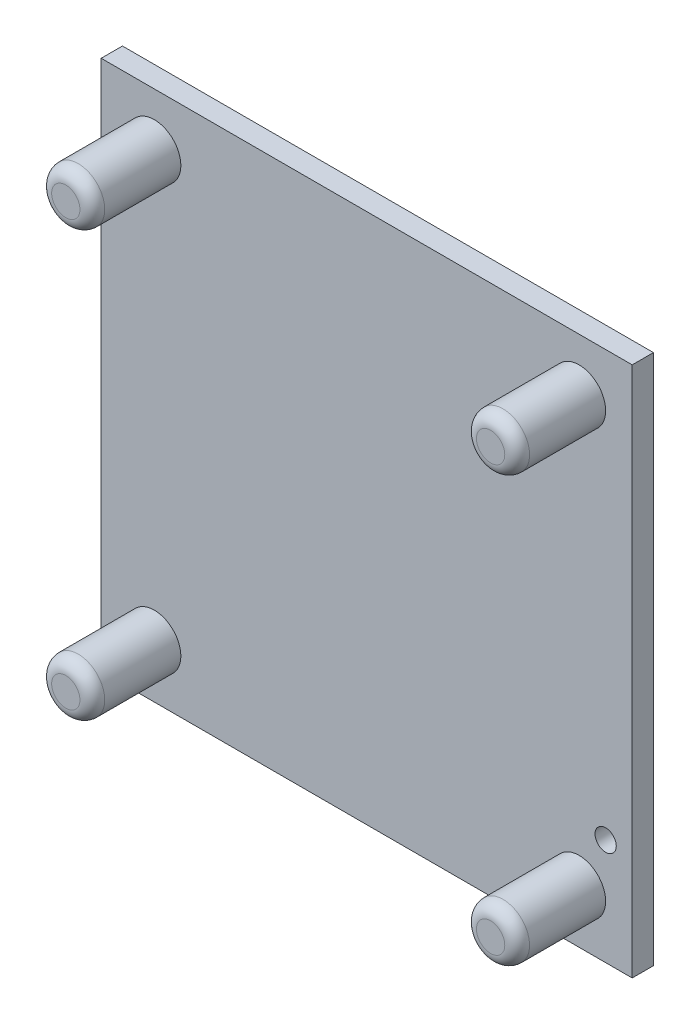
ISO-10303-21;
HEADER;
FILE_DESCRIPTION(('STEP AP214'),'2;1');
FILE_NAME('part.step','',(''),(''),'','','');
FILE_SCHEMA(('AUTOMOTIVE_DESIGN { 1 0 10303 214 1 1 1 1 }'));
ENDSEC;
DATA;
#1=APPLICATION_CONTEXT('core data for automotive mechanical design processes');
#2=APPLICATION_PROTOCOL_DEFINITION('international standard','automotive_design',2000,#1);
#3=PRODUCT_CONTEXT('',#1,'mechanical');
#4=PRODUCT('Part','Part','',(#3));
#5=PRODUCT_RELATED_PRODUCT_CATEGORY('part','',(#4));
#6=PRODUCT_DEFINITION_FORMATION('','',#4);
#7=PRODUCT_DEFINITION_CONTEXT('part definition',#1,'design');
#8=PRODUCT_DEFINITION('design','',#6,#7);
#9=PRODUCT_DEFINITION_SHAPE('','',#8);
#10=(LENGTH_UNIT() NAMED_UNIT(*) SI_UNIT(.MILLI.,.METRE.));
#11=(NAMED_UNIT(*) PLANE_ANGLE_UNIT() SI_UNIT($,.RADIAN.));
#12=(NAMED_UNIT(*) SI_UNIT($,.STERADIAN.) SOLID_ANGLE_UNIT());
#13=UNCERTAINTY_MEASURE_WITH_UNIT(LENGTH_MEASURE(1.E-05),#10,'distance_accuracy_value','');
#14=(GEOMETRIC_REPRESENTATION_CONTEXT(3) GLOBAL_UNCERTAINTY_ASSIGNED_CONTEXT((#13)) GLOBAL_UNIT_ASSIGNED_CONTEXT((#10,
#11,#12)) REPRESENTATION_CONTEXT('',''));
#15=CARTESIAN_POINT('',(0.,0.,0.));
#16=DIRECTION('',(0.,0.,1.));
#17=DIRECTION('',(1.,0.,0.));
#18=AXIS2_PLACEMENT_3D('',#15,#16,#17);
#19=CARTESIAN_POINT('',(150.,-150.,12.));
#20=DIRECTION('',(0.,0.,1.));
#21=DIRECTION('',(1.,0.,0.));
#22=AXIS2_PLACEMENT_3D('',#19,#20,#21);
#23=PLANE('',#22);
#24=CARTESIAN_POINT('',(135.,-90.,12.));
#25=DIRECTION('',(0.,0.,1.));
#26=DIRECTION('',(1.,0.,0.));
#27=AXIS2_PLACEMENT_3D('',#24,#25,#26);
#28=CIRCLE('',#27,6.00000000000001);
#29=CARTESIAN_POINT('',(141.,-90.,12.));
#30=VERTEX_POINT('',#29);
#31=EDGE_CURVE('E232',#30,#30,#28,.T.);
#32=ORIENTED_EDGE('',*,*,#31,.F.);
#33=EDGE_LOOP('',(#32));
#34=FACE_BOUND('',#33,.T.);
#35=CARTESIAN_POINT('',(-120.000000000001,120.,12.));
#36=DIRECTION('',(0.,0.,1.));
#37=DIRECTION('',(1.,0.,0.));
#38=AXIS2_PLACEMENT_3D('',#35,#36,#37);
#39=CIRCLE('',#38,15.);
#40=CARTESIAN_POINT('',(-105.000000000001,120.,12.));
#41=VERTEX_POINT('',#40);
#42=EDGE_CURVE('E221',#41,#41,#39,.T.);
#43=ORIENTED_EDGE('',*,*,#42,.F.);
#44=EDGE_LOOP('',(#43));
#45=FACE_BOUND('',#44,.T.);
#46=CARTESIAN_POINT('',(-120.,-120.,12.));
#47=DIRECTION('',(0.,0.,1.));
#48=DIRECTION('',(1.,0.,0.));
#49=AXIS2_PLACEMENT_3D('',#46,#47,#48);
#50=CIRCLE('',#49,15.);
#51=CARTESIAN_POINT('',(-105.,-120.,12.));
#52=VERTEX_POINT('',#51);
#53=EDGE_CURVE('E102',#52,#52,#50,.T.);
#54=ORIENTED_EDGE('',*,*,#53,.F.);
#55=EDGE_LOOP('',(#54));
#56=FACE_BOUND('',#55,.T.);
#57=DIRECTION('',(0.,1.,0.));
#58=VECTOR('',#57,1.);
#59=CARTESIAN_POINT('',(150.,150.,12.));
#60=LINE('',#59,#58);
#61=CARTESIAN_POINT('',(150.,-150.,12.));
#62=VERTEX_POINT('',#61);
#63=CARTESIAN_POINT('',(150.,150.,12.));
#64=VERTEX_POINT('',#63);
#65=EDGE_CURVE('E84',#62,#64,#60,.T.);
#66=ORIENTED_EDGE('',*,*,#65,.T.);
#67=DIRECTION('',(-1.,0.,0.));
#68=VECTOR('',#67,1.);
#69=CARTESIAN_POINT('',(-150.,150.,12.));
#70=LINE('',#69,#68);
#71=CARTESIAN_POINT('',(-150.,150.,12.));
#72=VERTEX_POINT('',#71);
#73=EDGE_CURVE('E79',#64,#72,#70,.T.);
#74=ORIENTED_EDGE('',*,*,#73,.T.);
#75=DIRECTION('',(0.,-1.,0.));
#76=VECTOR('',#75,1.);
#77=CARTESIAN_POINT('',(-150.,150.,12.));
#78=LINE('',#77,#76);
#79=CARTESIAN_POINT('',(-150.,-150.,12.));
#80=VERTEX_POINT('',#79);
#81=EDGE_CURVE('E82',#72,#80,#78,.T.);
#82=ORIENTED_EDGE('',*,*,#81,.T.);
#83=DIRECTION('',(1.,0.,0.));
#84=VECTOR('',#83,1.);
#85=CARTESIAN_POINT('',(-150.,-150.,12.));
#86=LINE('',#85,#84);
#87=EDGE_CURVE('E48',#80,#62,#86,.T.);
#88=ORIENTED_EDGE('',*,*,#87,.T.);
#89=EDGE_LOOP('',(#66,#74,#82,#88));
#90=FACE_BOUND('',#89,.T.);
#91=CARTESIAN_POINT('',(120.,-120.,12.));
#92=DIRECTION('',(0.,0.,1.));
#93=DIRECTION('',(1.,0.,0.));
#94=AXIS2_PLACEMENT_3D('',#91,#92,#93);
#95=CIRCLE('',#94,15.);
#96=CARTESIAN_POINT('',(135.,-120.,12.));
#97=VERTEX_POINT('',#96);
#98=EDGE_CURVE('E218',#97,#97,#95,.T.);
#99=ORIENTED_EDGE('',*,*,#98,.F.);
#100=EDGE_LOOP('',(#99));
#101=FACE_BOUND('',#100,.T.);
#102=CARTESIAN_POINT('',(119.999999999999,120.,12.));
#103=DIRECTION('',(0.,0.,1.));
#104=DIRECTION('',(1.,0.,0.));
#105=AXIS2_PLACEMENT_3D('',#102,#103,#104);
#106=CIRCLE('',#105,15.);
#107=CARTESIAN_POINT('',(134.999999999999,120.,12.));
#108=VERTEX_POINT('',#107);
#109=EDGE_CURVE('E226',#108,#108,#106,.T.);
#110=ORIENTED_EDGE('',*,*,#109,.F.);
#111=EDGE_LOOP('',(#110));
#112=FACE_BOUND('',#111,.T.);
#113=ADVANCED_FACE('F31',(#34,#45,#56,#90,#101,#112),#23,.T.);
#114=CARTESIAN_POINT('',(150.,150.,12.));
#115=DIRECTION('',(-1.,0.,0.));
#116=DIRECTION('',(0.,-1.,0.));
#117=AXIS2_PLACEMENT_3D('',#114,#115,#116);
#118=PLANE('',#117);
#119=DIRECTION('',(0.,1.,0.));
#120=VECTOR('',#119,1.);
#121=CARTESIAN_POINT('',(150.,150.,0.));
#122=LINE('',#121,#120);
#123=CARTESIAN_POINT('',(150.,-150.,0.));
#124=VERTEX_POINT('',#123);
#125=CARTESIAN_POINT('',(150.,150.,0.));
#126=VERTEX_POINT('',#125);
#127=EDGE_CURVE('E99',#124,#126,#122,.T.);
#128=ORIENTED_EDGE('',*,*,#127,.T.);
#129=DIRECTION('',(0.,0.,-1.));
#130=VECTOR('',#129,1.);
#131=CARTESIAN_POINT('',(150.,150.,12.));
#132=LINE('',#131,#130);
#133=EDGE_CURVE('E90',#64,#126,#132,.T.);
#134=ORIENTED_EDGE('',*,*,#133,.F.);
#135=ORIENTED_EDGE('',*,*,#65,.F.);
#136=DIRECTION('',(0.,0.,-1.));
#137=VECTOR('',#136,1.);
#138=CARTESIAN_POINT('',(150.,-150.,12.));
#139=LINE('',#138,#137);
#140=EDGE_CURVE('E95',#62,#124,#139,.T.);
#141=ORIENTED_EDGE('',*,*,#140,.T.);
#142=EDGE_LOOP('',(#128,#134,#135,#141));
#143=FACE_BOUND('',#142,.T.);
#144=ADVANCED_FACE('F145',(#143),#118,.F.);
#145=CARTESIAN_POINT('',(-150.,150.,12.));
#146=DIRECTION('',(0.,-1.,0.));
#147=DIRECTION('',(0.,0.,-1.));
#148=AXIS2_PLACEMENT_3D('',#145,#146,#147);
#149=PLANE('',#148);
#150=DIRECTION('',(-1.,0.,0.));
#151=VECTOR('',#150,1.);
#152=CARTESIAN_POINT('',(-150.,150.,0.));
#153=LINE('',#152,#151);
#154=CARTESIAN_POINT('',(-150.,150.,0.));
#155=VERTEX_POINT('',#154);
#156=EDGE_CURVE('E89',#126,#155,#153,.T.);
#157=ORIENTED_EDGE('',*,*,#156,.T.);
#158=DIRECTION('',(0.,0.,-1.));
#159=VECTOR('',#158,1.);
#160=CARTESIAN_POINT('',(-150.,150.,12.));
#161=LINE('',#160,#159);
#162=EDGE_CURVE('E87',#72,#155,#161,.T.);
#163=ORIENTED_EDGE('',*,*,#162,.F.);
#164=ORIENTED_EDGE('',*,*,#73,.F.);
#165=ORIENTED_EDGE('',*,*,#133,.T.);
#166=EDGE_LOOP('',(#157,#163,#164,#165));
#167=FACE_BOUND('',#166,.T.);
#168=ADVANCED_FACE('F88',(#167),#149,.F.);
#169=CARTESIAN_POINT('',(-150.,150.,12.));
#170=DIRECTION('',(1.,0.,0.));
#171=DIRECTION('',(0.,1.,0.));
#172=AXIS2_PLACEMENT_3D('',#169,#170,#171);
#173=PLANE('',#172);
#174=DIRECTION('',(0.,-1.,0.));
#175=VECTOR('',#174,1.);
#176=CARTESIAN_POINT('',(-150.,150.,0.));
#177=LINE('',#176,#175);
#178=CARTESIAN_POINT('',(-150.,-150.,0.));
#179=VERTEX_POINT('',#178);
#180=EDGE_CURVE('E65',#155,#179,#177,.T.);
#181=ORIENTED_EDGE('',*,*,#180,.T.);
#182=DIRECTION('',(0.,0.,-1.));
#183=VECTOR('',#182,1.);
#184=CARTESIAN_POINT('',(-150.,-150.,12.));
#185=LINE('',#184,#183);
#186=EDGE_CURVE('E91',#80,#179,#185,.T.);
#187=ORIENTED_EDGE('',*,*,#186,.F.);
#188=ORIENTED_EDGE('',*,*,#81,.F.);
#189=ORIENTED_EDGE('',*,*,#162,.T.);
#190=EDGE_LOOP('',(#181,#187,#188,#189));
#191=FACE_BOUND('',#190,.T.);
#192=ADVANCED_FACE('F93',(#191),#173,.F.);
#193=CARTESIAN_POINT('',(-150.,-150.,12.));
#194=DIRECTION('',(0.,1.,0.));
#195=DIRECTION('',(0.,0.,1.));
#196=AXIS2_PLACEMENT_3D('',#193,#194,#195);
#197=PLANE('',#196);
#198=DIRECTION('',(1.,0.,0.));
#199=VECTOR('',#198,1.);
#200=CARTESIAN_POINT('',(-150.,-150.,0.));
#201=LINE('',#200,#199);
#202=EDGE_CURVE('E71',#179,#124,#201,.T.);
#203=ORIENTED_EDGE('',*,*,#202,.T.);
#204=ORIENTED_EDGE('',*,*,#140,.F.);
#205=ORIENTED_EDGE('',*,*,#87,.F.);
#206=ORIENTED_EDGE('',*,*,#186,.T.);
#207=EDGE_LOOP('',(#203,#204,#205,#206));
#208=FACE_BOUND('',#207,.T.);
#209=ADVANCED_FACE('F162',(#208),#197,.F.);
#210=CARTESIAN_POINT('',(150.,-150.,0.));
#211=DIRECTION('',(0.,0.,1.));
#212=DIRECTION('',(1.,0.,0.));
#213=AXIS2_PLACEMENT_3D('',#210,#211,#212);
#214=PLANE('',#213);
#215=CARTESIAN_POINT('',(135.,-90.,0.));
#216=DIRECTION('',(0.,0.,1.));
#217=DIRECTION('',(1.,0.,0.));
#218=AXIS2_PLACEMENT_3D('',#215,#216,#217);
#219=CIRCLE('',#218,6.00000000000001);
#220=CARTESIAN_POINT('',(141.,-90.,0.));
#221=VERTEX_POINT('',#220);
#222=EDGE_CURVE('E229',#221,#221,#219,.T.);
#223=ORIENTED_EDGE('',*,*,#222,.T.);
#224=EDGE_LOOP('',(#223));
#225=FACE_BOUND('',#224,.T.);
#226=ORIENTED_EDGE('',*,*,#127,.F.);
#227=ORIENTED_EDGE('',*,*,#202,.F.);
#228=ORIENTED_EDGE('',*,*,#180,.F.);
#229=ORIENTED_EDGE('',*,*,#156,.F.);
#230=EDGE_LOOP('',(#226,#227,#228,#229));
#231=FACE_BOUND('',#230,.T.);
#232=ADVANCED_FACE('F160',(#225,#231),#214,.F.);
#233=CARTESIAN_POINT('',(-120.,-120.,62.));
#234=DIRECTION('',(0.,0.,-1.));
#235=DIRECTION('',(-1.,0.,0.));
#236=AXIS2_PLACEMENT_3D('',#233,#234,#235);
#237=CYLINDRICAL_SURFACE('',#236,15.);
#238=CARTESIAN_POINT('',(-120.,-120.,55.));
#239=DIRECTION('',(0.,0.,1.));
#240=DIRECTION('',(1.,0.,0.));
#241=AXIS2_PLACEMENT_3D('',#238,#239,#240);
#242=CIRCLE('',#241,15.);
#243=CARTESIAN_POINT('',(-105.,-120.,55.));
#244=VERTEX_POINT('',#243);
#245=EDGE_CURVE('E11',#244,#244,#242,.F.);
#246=ORIENTED_EDGE('',*,*,#245,.T.);
#247=EDGE_LOOP('',(#246));
#248=FACE_BOUND('',#247,.T.);
#249=ORIENTED_EDGE('',*,*,#53,.T.);
#250=EDGE_LOOP('',(#249));
#251=FACE_BOUND('',#250,.T.);
#252=ADVANCED_FACE('F158',(#248,#251),#237,.T.);
#253=CARTESIAN_POINT('',(-120.,-120.,62.));
#254=DIRECTION('',(0.,0.,1.));
#255=DIRECTION('',(1.,0.,0.));
#256=AXIS2_PLACEMENT_3D('',#253,#254,#255);
#257=PLANE('',#256);
#258=CARTESIAN_POINT('',(-120.,-120.,62.));
#259=DIRECTION('',(0.,0.,1.));
#260=DIRECTION('',(1.,0.,0.));
#261=AXIS2_PLACEMENT_3D('',#258,#259,#260);
#262=CIRCLE('',#261,8.);
#263=CARTESIAN_POINT('',(-112.,-120.,62.));
#264=VERTEX_POINT('',#263);
#265=EDGE_CURVE('E40',#264,#264,#262,.T.);
#266=ORIENTED_EDGE('',*,*,#265,.T.);
#267=EDGE_LOOP('',(#266));
#268=FACE_BOUND('',#267,.T.);
#269=ADVANCED_FACE('F129',(#268),#257,.T.);
#270=CARTESIAN_POINT('',(120.,-120.,62.));
#271=DIRECTION('',(0.,0.,-1.));
#272=DIRECTION('',(-1.,0.,0.));
#273=AXIS2_PLACEMENT_3D('',#270,#271,#272);
#274=CYLINDRICAL_SURFACE('',#273,15.);
#275=CARTESIAN_POINT('',(120.,-120.,55.));
#276=DIRECTION('',(0.,0.,1.));
#277=DIRECTION('',(1.,0.,0.));
#278=AXIS2_PLACEMENT_3D('',#275,#276,#277);
#279=CIRCLE('',#278,15.);
#280=CARTESIAN_POINT('',(135.,-120.,55.));
#281=VERTEX_POINT('',#280);
#282=EDGE_CURVE('E112',#281,#281,#279,.F.);
#283=ORIENTED_EDGE('',*,*,#282,.T.);
#284=EDGE_LOOP('',(#283));
#285=FACE_BOUND('',#284,.T.);
#286=ORIENTED_EDGE('',*,*,#98,.T.);
#287=EDGE_LOOP('',(#286));
#288=FACE_BOUND('',#287,.T.);
#289=ADVANCED_FACE('F203',(#285,#288),#274,.T.);
#290=CARTESIAN_POINT('',(120.,-120.,62.));
#291=DIRECTION('',(0.,0.,1.));
#292=DIRECTION('',(1.,0.,0.));
#293=AXIS2_PLACEMENT_3D('',#290,#291,#292);
#294=PLANE('',#293);
#295=CARTESIAN_POINT('',(120.,-120.,62.));
#296=DIRECTION('',(0.,0.,1.));
#297=DIRECTION('',(1.,0.,0.));
#298=AXIS2_PLACEMENT_3D('',#295,#296,#297);
#299=CIRCLE('',#298,8.);
#300=CARTESIAN_POINT('',(128.,-120.,62.));
#301=VERTEX_POINT('',#300);
#302=EDGE_CURVE('E109',#301,#301,#299,.T.);
#303=ORIENTED_EDGE('',*,*,#302,.T.);
#304=EDGE_LOOP('',(#303));
#305=FACE_BOUND('',#304,.T.);
#306=ADVANCED_FACE('F199',(#305),#294,.T.);
#307=CARTESIAN_POINT('',(-120.000000000001,120.,62.));
#308=DIRECTION('',(0.,0.,-1.));
#309=DIRECTION('',(-1.,0.,0.));
#310=AXIS2_PLACEMENT_3D('',#307,#308,#309);
#311=CYLINDRICAL_SURFACE('',#310,15.);
#312=CARTESIAN_POINT('',(-120.000000000001,120.,55.));
#313=DIRECTION('',(0.,0.,1.));
#314=DIRECTION('',(1.,0.,0.));
#315=AXIS2_PLACEMENT_3D('',#312,#313,#314);
#316=CIRCLE('',#315,15.);
#317=CARTESIAN_POINT('',(-105.000000000001,120.,55.));
#318=VERTEX_POINT('',#317);
#319=EDGE_CURVE('E124',#318,#318,#316,.F.);
#320=ORIENTED_EDGE('',*,*,#319,.T.);
#321=EDGE_LOOP('',(#320));
#322=FACE_BOUND('',#321,.T.);
#323=ORIENTED_EDGE('',*,*,#42,.T.);
#324=EDGE_LOOP('',(#323));
#325=FACE_BOUND('',#324,.T.);
#326=ADVANCED_FACE('F195',(#322,#325),#311,.T.);
#327=CARTESIAN_POINT('',(-120.000000000001,120.,62.));
#328=DIRECTION('',(0.,0.,1.));
#329=DIRECTION('',(1.,0.,0.));
#330=AXIS2_PLACEMENT_3D('',#327,#328,#329);
#331=PLANE('',#330);
#332=CARTESIAN_POINT('',(-120.000000000001,120.,62.));
#333=DIRECTION('',(0.,0.,1.));
#334=DIRECTION('',(1.,0.,0.));
#335=AXIS2_PLACEMENT_3D('',#332,#333,#334);
#336=CIRCLE('',#335,8.);
#337=CARTESIAN_POINT('',(-112.000000000001,120.,62.));
#338=VERTEX_POINT('',#337);
#339=EDGE_CURVE('E121',#338,#338,#336,.T.);
#340=ORIENTED_EDGE('',*,*,#339,.T.);
#341=EDGE_LOOP('',(#340));
#342=FACE_BOUND('',#341,.T.);
#343=ADVANCED_FACE('F189',(#342),#331,.T.);
#344=CARTESIAN_POINT('',(119.999999999999,120.,62.));
#345=DIRECTION('',(0.,0.,-1.));
#346=DIRECTION('',(-1.,0.,0.));
#347=AXIS2_PLACEMENT_3D('',#344,#345,#346);
#348=CYLINDRICAL_SURFACE('',#347,15.);
#349=CARTESIAN_POINT('',(119.999999999999,120.,55.));
#350=DIRECTION('',(0.,0.,1.));
#351=DIRECTION('',(1.,0.,0.));
#352=AXIS2_PLACEMENT_3D('',#349,#350,#351);
#353=CIRCLE('',#352,15.);
#354=CARTESIAN_POINT('',(134.999999999999,120.,55.));
#355=VERTEX_POINT('',#354);
#356=EDGE_CURVE('E118',#355,#355,#353,.F.);
#357=ORIENTED_EDGE('',*,*,#356,.T.);
#358=EDGE_LOOP('',(#357));
#359=FACE_BOUND('',#358,.T.);
#360=ORIENTED_EDGE('',*,*,#109,.T.);
#361=EDGE_LOOP('',(#360));
#362=FACE_BOUND('',#361,.T.);
#363=ADVANCED_FACE('F184',(#359,#362),#348,.T.);
#364=CARTESIAN_POINT('',(119.999999999999,120.,62.));
#365=DIRECTION('',(0.,0.,1.));
#366=DIRECTION('',(1.,0.,0.));
#367=AXIS2_PLACEMENT_3D('',#364,#365,#366);
#368=PLANE('',#367);
#369=CARTESIAN_POINT('',(119.999999999999,120.,62.));
#370=DIRECTION('',(0.,0.,1.));
#371=DIRECTION('',(1.,0.,0.));
#372=AXIS2_PLACEMENT_3D('',#369,#370,#371);
#373=CIRCLE('',#372,8.);
#374=CARTESIAN_POINT('',(127.999999999999,120.,62.));
#375=VERTEX_POINT('',#374);
#376=EDGE_CURVE('E115',#375,#375,#373,.T.);
#377=ORIENTED_EDGE('',*,*,#376,.T.);
#378=EDGE_LOOP('',(#377));
#379=FACE_BOUND('',#378,.T.);
#380=ADVANCED_FACE('F173',(#379),#368,.T.);
#381=CARTESIAN_POINT('',(120.,-120.,55.));
#382=DIRECTION('',(0.,0.,1.));
#383=DIRECTION('',(1.,0.,0.));
#384=AXIS2_PLACEMENT_3D('',#381,#382,#383);
#385=TOROIDAL_SURFACE('',#384,8.,7.);
#386=ORIENTED_EDGE('',*,*,#282,.F.);
#387=EDGE_LOOP('',(#386));
#388=FACE_BOUND('',#387,.T.);
#389=ORIENTED_EDGE('',*,*,#302,.F.);
#390=EDGE_LOOP('',(#389));
#391=FACE_BOUND('',#390,.T.);
#392=ADVANCED_FACE('F170',(#388,#391),#385,.T.);
#393=CARTESIAN_POINT('',(119.999999999999,120.,55.));
#394=DIRECTION('',(0.,0.,1.));
#395=DIRECTION('',(1.,0.,0.));
#396=AXIS2_PLACEMENT_3D('',#393,#394,#395);
#397=TOROIDAL_SURFACE('',#396,8.,7.);
#398=ORIENTED_EDGE('',*,*,#356,.F.);
#399=EDGE_LOOP('',(#398));
#400=FACE_BOUND('',#399,.T.);
#401=ORIENTED_EDGE('',*,*,#376,.F.);
#402=EDGE_LOOP('',(#401));
#403=FACE_BOUND('',#402,.T.);
#404=ADVANCED_FACE('F141',(#400,#403),#397,.T.);
#405=CARTESIAN_POINT('',(-120.000000000001,120.,55.));
#406=DIRECTION('',(0.,0.,1.));
#407=DIRECTION('',(1.,0.,0.));
#408=AXIS2_PLACEMENT_3D('',#405,#406,#407);
#409=TOROIDAL_SURFACE('',#408,8.,7.);
#410=ORIENTED_EDGE('',*,*,#319,.F.);
#411=EDGE_LOOP('',(#410));
#412=FACE_BOUND('',#411,.T.);
#413=ORIENTED_EDGE('',*,*,#339,.F.);
#414=EDGE_LOOP('',(#413));
#415=FACE_BOUND('',#414,.T.);
#416=ADVANCED_FACE('F133',(#412,#415),#409,.T.);
#417=CARTESIAN_POINT('',(-120.,-120.,55.));
#418=DIRECTION('',(0.,0.,1.));
#419=DIRECTION('',(1.,0.,0.));
#420=AXIS2_PLACEMENT_3D('',#417,#418,#419);
#421=TOROIDAL_SURFACE('',#420,8.,7.);
#422=ORIENTED_EDGE('',*,*,#245,.F.);
#423=EDGE_LOOP('',(#422));
#424=FACE_BOUND('',#423,.T.);
#425=ORIENTED_EDGE('',*,*,#265,.F.);
#426=EDGE_LOOP('',(#425));
#427=FACE_BOUND('',#426,.T.);
#428=ADVANCED_FACE('F33',(#424,#427),#421,.T.);
#429=CARTESIAN_POINT('',(135.,-90.,12.));
#430=DIRECTION('',(0.,0.,1.));
#431=DIRECTION('',(1.,0.,0.));
#432=AXIS2_PLACEMENT_3D('',#429,#430,#431);
#433=CYLINDRICAL_SURFACE('',#432,6.00000000000001);
#434=ORIENTED_EDGE('',*,*,#222,.F.);
#435=EDGE_LOOP('',(#434));
#436=FACE_BOUND('',#435,.T.);
#437=ORIENTED_EDGE('',*,*,#31,.T.);
#438=EDGE_LOOP('',(#437));
#439=FACE_BOUND('',#438,.T.);
#440=ADVANCED_FACE('F132',(#436,#439),#433,.F.);
#441=CLOSED_SHELL('',(#113,#144,#168,#192,#209,#232,#252,#269,#289,#306,#326,#343,#363,#380,
#392,#404,#416,#428,#440));
#442=MANIFOLD_SOLID_BREP('B2',#441);
#443=ADVANCED_BREP_SHAPE_REPRESENTATION('',(#18,#442),#14);
#444=SHAPE_DEFINITION_REPRESENTATION(#9,#443);
ENDSEC;
END-ISO-10303-21;
